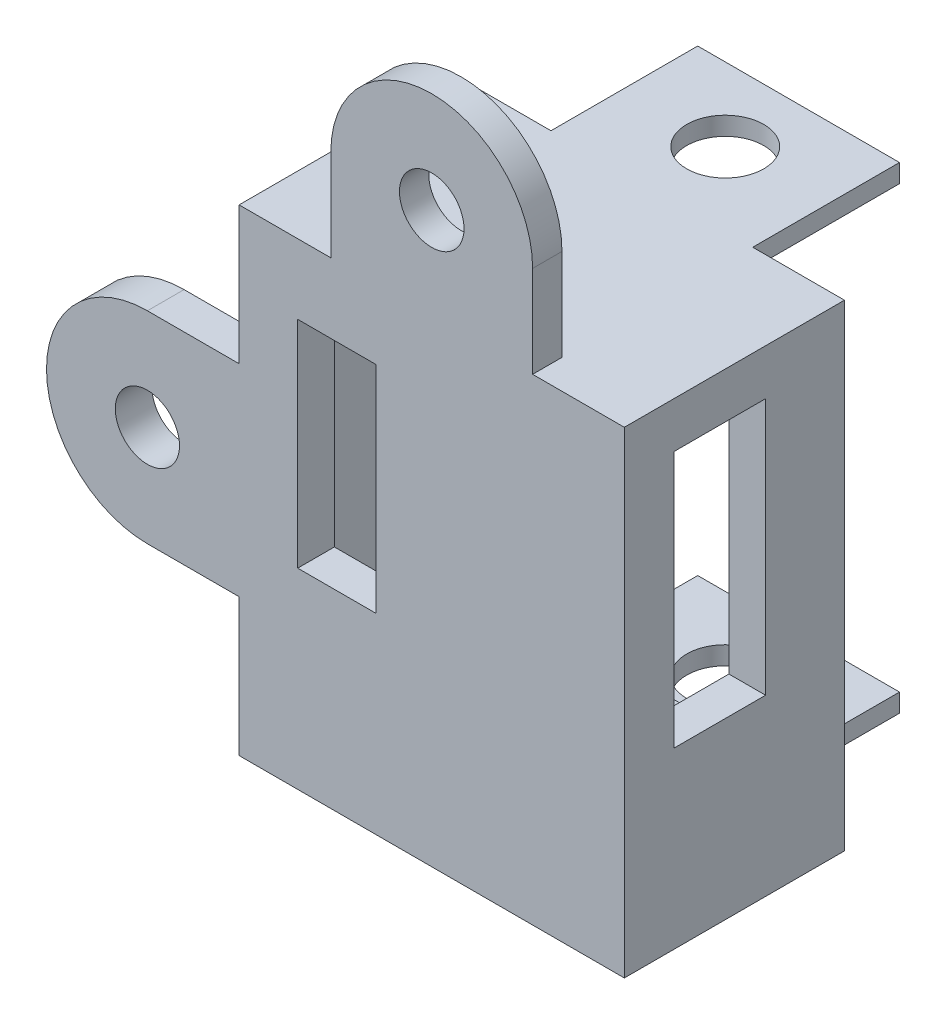
ISO-10303-21;
HEADER;
FILE_DESCRIPTION(('STEP AP214'),'2;1');
FILE_NAME('part.step','',(''),(''),'','','');
FILE_SCHEMA(('AUTOMOTIVE_DESIGN { 1 0 10303 214 1 1 1 1 }'));
ENDSEC;
DATA;
#1=APPLICATION_CONTEXT('core data for automotive mechanical design processes');
#2=APPLICATION_PROTOCOL_DEFINITION('international standard','automotive_design',2000,#1);
#3=PRODUCT_CONTEXT('',#1,'mechanical');
#4=PRODUCT('Part','Part','',(#3));
#5=PRODUCT_RELATED_PRODUCT_CATEGORY('part','',(#4));
#6=PRODUCT_DEFINITION_FORMATION('','',#4);
#7=PRODUCT_DEFINITION_CONTEXT('part definition',#1,'design');
#8=PRODUCT_DEFINITION('design','',#6,#7);
#9=PRODUCT_DEFINITION_SHAPE('','',#8);
#10=(LENGTH_UNIT() NAMED_UNIT(*) SI_UNIT(.MILLI.,.METRE.));
#11=(NAMED_UNIT(*) PLANE_ANGLE_UNIT() SI_UNIT($,.RADIAN.));
#12=(NAMED_UNIT(*) SI_UNIT($,.STERADIAN.) SOLID_ANGLE_UNIT());
#13=UNCERTAINTY_MEASURE_WITH_UNIT(LENGTH_MEASURE(1.E-05),#10,'distance_accuracy_value','');
#14=(GEOMETRIC_REPRESENTATION_CONTEXT(3) GLOBAL_UNCERTAINTY_ASSIGNED_CONTEXT((#13)) GLOBAL_UNIT_ASSIGNED_CONTEXT((#10,
#11,#12)) REPRESENTATION_CONTEXT('',''));
#15=CARTESIAN_POINT('',(0.,0.,0.));
#16=DIRECTION('',(0.,0.,1.));
#17=DIRECTION('',(1.,0.,0.));
#18=AXIS2_PLACEMENT_3D('',#15,#16,#17);
#19=CARTESIAN_POINT('',(-10.5,-13.,10.));
#20=DIRECTION('',(1.,0.,0.));
#21=DIRECTION('',(0.,0.,-1.));
#22=AXIS2_PLACEMENT_3D('',#19,#20,#21);
#23=PLANE('',#22);
#24=DIRECTION('',(0.,0.,1.));
#25=VECTOR('',#24,1.);
#26=CARTESIAN_POINT('',(-10.5,-5.5,10.));
#27=LINE('',#26,#25);
#28=CARTESIAN_POINT('',(-10.5,-5.5,10.));
#29=VERTEX_POINT('',#28);
#30=CARTESIAN_POINT('',(-10.5,-5.5,12.));
#31=VERTEX_POINT('',#30);
#32=EDGE_CURVE('E301',#29,#31,#27,.T.);
#33=ORIENTED_EDGE('',*,*,#32,.F.);
#34=DIRECTION('',(0.,1.,0.));
#35=VECTOR('',#34,1.);
#36=CARTESIAN_POINT('',(-10.5,0.,10.));
#37=LINE('',#36,#35);
#38=CARTESIAN_POINT('',(-10.5,5.5,10.));
#39=VERTEX_POINT('',#38);
#40=EDGE_CURVE('E280',#29,#39,#37,.T.);
#41=ORIENTED_EDGE('',*,*,#40,.T.);
#42=DIRECTION('',(0.,0.,1.));
#43=VECTOR('',#42,1.);
#44=CARTESIAN_POINT('',(-10.5,5.5,10.));
#45=LINE('',#44,#43);
#46=CARTESIAN_POINT('',(-10.5,5.5,12.));
#47=VERTEX_POINT('',#46);
#48=EDGE_CURVE('E293',#39,#47,#45,.T.);
#49=ORIENTED_EDGE('',*,*,#48,.T.);
#50=DIRECTION('',(0.,-1.,0.));
#51=VECTOR('',#50,1.);
#52=CARTESIAN_POINT('',(-10.5,-13.,12.));
#53=LINE('',#52,#51);
#54=CARTESIAN_POINT('',(-10.5,13.,12.));
#55=VERTEX_POINT('',#54);
#56=EDGE_CURVE('E448',#55,#47,#53,.T.);
#57=ORIENTED_EDGE('',*,*,#56,.F.);
#58=DIRECTION('',(0.,0.,-1.));
#59=VECTOR('',#58,1.);
#60=CARTESIAN_POINT('',(-10.5,13.,10.));
#61=LINE('',#60,#59);
#62=CARTESIAN_POINT('',(-10.5,13.,0.));
#63=VERTEX_POINT('',#62);
#64=EDGE_CURVE('E507',#55,#63,#61,.T.);
#65=ORIENTED_EDGE('',*,*,#64,.T.);
#66=DIRECTION('',(0.,-1.,0.));
#67=VECTOR('',#66,1.);
#68=CARTESIAN_POINT('',(-10.5,-13.,0.));
#69=LINE('',#68,#67);
#70=CARTESIAN_POINT('',(-10.5,-13.,0.));
#71=VERTEX_POINT('',#70);
#72=EDGE_CURVE('E495',#63,#71,#69,.T.);
#73=ORIENTED_EDGE('',*,*,#72,.T.);
#74=DIRECTION('',(0.,0.,-1.));
#75=VECTOR('',#74,1.);
#76=CARTESIAN_POINT('',(-10.5,-13.,10.));
#77=LINE('',#76,#75);
#78=CARTESIAN_POINT('',(-10.5,-13.,12.));
#79=VERTEX_POINT('',#78);
#80=EDGE_CURVE('E504',#79,#71,#77,.T.);
#81=ORIENTED_EDGE('',*,*,#80,.F.);
#82=EDGE_CURVE('E447',#31,#79,#53,.T.);
#83=ORIENTED_EDGE('',*,*,#82,.F.);
#84=EDGE_LOOP('',(#33,#41,#49,#57,#65,#73,#81,#83));
#85=FACE_BOUND('',#84,.T.);
#86=ADVANCED_FACE('F36',(#85),#23,.F.);
#87=CARTESIAN_POINT('',(0.,0.,0.));
#88=DIRECTION('',(0.,0.,-1.));
#89=DIRECTION('',(-1.,0.,0.));
#90=AXIS2_PLACEMENT_3D('',#87,#88,#89);
#91=PLANE('',#90);
#92=DIRECTION('',(1.,0.,0.));
#93=VECTOR('',#92,1.);
#94=CARTESIAN_POINT('',(-8.5,-10.5,0.));
#95=LINE('',#94,#93);
#96=CARTESIAN_POINT('',(-8.5,-10.5,0.));
#97=VERTEX_POINT('',#96);
#98=CARTESIAN_POINT('',(8.5,-10.5,0.));
#99=VERTEX_POINT('',#98);
#100=EDGE_CURVE('E458',#97,#99,#95,.T.);
#101=ORIENTED_EDGE('',*,*,#100,.T.);
#102=DIRECTION('',(0.,1.,0.));
#103=VECTOR('',#102,1.);
#104=CARTESIAN_POINT('',(8.5,-10.5,0.));
#105=LINE('',#104,#103);
#106=CARTESIAN_POINT('',(8.5,10.5,0.));
#107=VERTEX_POINT('',#106);
#108=EDGE_CURVE('E453',#99,#107,#105,.T.);
#109=ORIENTED_EDGE('',*,*,#108,.T.);
#110=DIRECTION('',(-1.,0.,0.));
#111=VECTOR('',#110,1.);
#112=CARTESIAN_POINT('',(-8.5,10.5,0.));
#113=LINE('',#112,#111);
#114=CARTESIAN_POINT('',(-8.5,10.5,0.));
#115=VERTEX_POINT('',#114);
#116=EDGE_CURVE('E470',#107,#115,#113,.T.);
#117=ORIENTED_EDGE('',*,*,#116,.T.);
#118=DIRECTION('',(0.,-1.,0.));
#119=VECTOR('',#118,1.);
#120=CARTESIAN_POINT('',(-8.5,-10.5,0.));
#121=LINE('',#120,#119);
#122=EDGE_CURVE('E473',#115,#97,#121,.T.);
#123=ORIENTED_EDGE('',*,*,#122,.T.);
#124=EDGE_LOOP('',(#101,#109,#117,#123));
#125=FACE_BOUND('',#124,.T.);
#126=DIRECTION('',(-1.,0.,0.));
#127=VECTOR('',#126,1.);
#128=CARTESIAN_POINT('',(-5.5,12.,0.));
#129=LINE('',#128,#127);
#130=CARTESIAN_POINT('',(5.5,12.,0.));
#131=VERTEX_POINT('',#130);
#132=CARTESIAN_POINT('',(-5.5,12.,0.));
#133=VERTEX_POINT('',#132);
#134=EDGE_CURVE('E333',#131,#133,#129,.T.);
#135=ORIENTED_EDGE('',*,*,#134,.F.);
#136=DIRECTION('',(0.,-1.,0.));
#137=VECTOR('',#136,1.);
#138=CARTESIAN_POINT('',(5.5,12.,0.));
#139=LINE('',#138,#137);
#140=CARTESIAN_POINT('',(5.5,13.,0.));
#141=VERTEX_POINT('',#140);
#142=EDGE_CURVE('E319',#141,#131,#139,.T.);
#143=ORIENTED_EDGE('',*,*,#142,.F.);
#144=DIRECTION('',(-1.,0.,0.));
#145=VECTOR('',#144,1.);
#146=CARTESIAN_POINT('',(-10.5,13.,0.));
#147=LINE('',#146,#145);
#148=CARTESIAN_POINT('',(10.5,13.,0.));
#149=VERTEX_POINT('',#148);
#150=EDGE_CURVE('E492',#149,#141,#147,.T.);
#151=ORIENTED_EDGE('',*,*,#150,.F.);
#152=DIRECTION('',(0.,1.,0.));
#153=VECTOR('',#152,1.);
#154=CARTESIAN_POINT('',(10.5,-13.,0.));
#155=LINE('',#154,#153);
#156=CARTESIAN_POINT('',(10.5,-13.,0.));
#157=VERTEX_POINT('',#156);
#158=EDGE_CURVE('E488',#157,#149,#155,.T.);
#159=ORIENTED_EDGE('',*,*,#158,.F.);
#160=DIRECTION('',(1.,0.,0.));
#161=VECTOR('',#160,1.);
#162=CARTESIAN_POINT('',(-10.5,-13.,0.));
#163=LINE('',#162,#161);
#164=CARTESIAN_POINT('',(5.49999999999999,-13.,0.));
#165=VERTEX_POINT('',#164);
#166=EDGE_CURVE('E497',#165,#157,#163,.T.);
#167=ORIENTED_EDGE('',*,*,#166,.F.);
#168=DIRECTION('',(0.,-1.,0.));
#169=VECTOR('',#168,1.);
#170=CARTESIAN_POINT('',(5.5,-12.,0.));
#171=LINE('',#170,#169);
#172=CARTESIAN_POINT('',(5.5,-12.,0.));
#173=VERTEX_POINT('',#172);
#174=EDGE_CURVE('E345',#173,#165,#171,.T.);
#175=ORIENTED_EDGE('',*,*,#174,.F.);
#176=DIRECTION('',(1.,0.,0.));
#177=VECTOR('',#176,1.);
#178=CARTESIAN_POINT('',(-5.5,-12.,0.));
#179=LINE('',#178,#177);
#180=CARTESIAN_POINT('',(-5.5,-12.,0.));
#181=VERTEX_POINT('',#180);
#182=EDGE_CURVE('E350',#181,#173,#179,.T.);
#183=ORIENTED_EDGE('',*,*,#182,.F.);
#184=DIRECTION('',(0.,1.,0.));
#185=VECTOR('',#184,1.);
#186=CARTESIAN_POINT('',(-5.5,-13.,0.));
#187=LINE('',#186,#185);
#188=CARTESIAN_POINT('',(-5.5,-13.,0.));
#189=VERTEX_POINT('',#188);
#190=EDGE_CURVE('E359',#189,#181,#187,.T.);
#191=ORIENTED_EDGE('',*,*,#190,.F.);
#192=EDGE_CURVE('E498',#71,#189,#163,.T.);
#193=ORIENTED_EDGE('',*,*,#192,.F.);
#194=ORIENTED_EDGE('',*,*,#72,.F.);
#195=CARTESIAN_POINT('',(-5.5,13.,0.));
#196=VERTEX_POINT('',#195);
#197=EDGE_CURVE('E491',#196,#63,#147,.T.);
#198=ORIENTED_EDGE('',*,*,#197,.F.);
#199=DIRECTION('',(0.,1.,0.));
#200=VECTOR('',#199,1.);
#201=CARTESIAN_POINT('',(-5.5,13.,0.));
#202=LINE('',#201,#200);
#203=EDGE_CURVE('E324',#133,#196,#202,.T.);
#204=ORIENTED_EDGE('',*,*,#203,.F.);
#205=EDGE_LOOP('',(#135,#143,#151,#159,#167,#175,#183,#191,#193,#194,#198,#204));
#206=FACE_BOUND('',#205,.T.);
#207=ADVANCED_FACE('F538',(#125,#206),#91,.T.);
#208=CARTESIAN_POINT('',(-10.5,-13.,10.));
#209=DIRECTION('',(0.,1.,0.));
#210=DIRECTION('',(0.,0.,1.));
#211=AXIS2_PLACEMENT_3D('',#208,#209,#210);
#212=PLANE('',#211);
#213=DIRECTION('',(0.,0.,-1.));
#214=VECTOR('',#213,1.);
#215=CARTESIAN_POINT('',(10.5,-13.,10.));
#216=LINE('',#215,#214);
#217=CARTESIAN_POINT('',(10.5,-13.,12.));
#218=VERTEX_POINT('',#217);
#219=EDGE_CURVE('E501',#218,#157,#216,.T.);
#220=ORIENTED_EDGE('',*,*,#219,.F.);
#221=DIRECTION('',(1.,0.,0.));
#222=VECTOR('',#221,1.);
#223=CARTESIAN_POINT('',(-10.5,-13.,12.));
#224=LINE('',#223,#222);
#225=EDGE_CURVE('E451',#79,#218,#224,.T.);
#226=ORIENTED_EDGE('',*,*,#225,.F.);
#227=ORIENTED_EDGE('',*,*,#80,.T.);
#228=ORIENTED_EDGE('',*,*,#192,.T.);
#229=DIRECTION('',(0.,0.,1.));
#230=VECTOR('',#229,1.);
#231=CARTESIAN_POINT('',(-5.5,-13.,-8.));
#232=LINE('',#231,#230);
#233=CARTESIAN_POINT('',(-5.5,-13.,-8.));
#234=VERTEX_POINT('',#233);
#235=EDGE_CURVE('E369',#234,#189,#232,.T.);
#236=ORIENTED_EDGE('',*,*,#235,.F.);
#237=DIRECTION('',(-1.,0.,0.));
#238=VECTOR('',#237,1.);
#239=CARTESIAN_POINT('',(5.5,-13.,-8.));
#240=LINE('',#239,#238);
#241=CARTESIAN_POINT('',(5.5,-13.,-8.));
#242=VERTEX_POINT('',#241);
#243=EDGE_CURVE('E349',#242,#234,#240,.T.);
#244=ORIENTED_EDGE('',*,*,#243,.F.);
#245=DIRECTION('',(0.,0.,1.));
#246=VECTOR('',#245,1.);
#247=CARTESIAN_POINT('',(5.5,-13.,-8.));
#248=LINE('',#247,#246);
#249=EDGE_CURVE('E372',#242,#165,#248,.T.);
#250=ORIENTED_EDGE('',*,*,#249,.T.);
#251=ORIENTED_EDGE('',*,*,#166,.T.);
#252=EDGE_LOOP('',(#220,#226,#227,#228,#236,#244,#250,#251));
#253=FACE_BOUND('',#252,.T.);
#254=CARTESIAN_POINT('',(0.,-13.,-4.));
#255=DIRECTION('',(0.,1.,0.));
#256=DIRECTION('',(0.,0.,1.));
#257=AXIS2_PLACEMENT_3D('',#254,#255,#256);
#258=CIRCLE('',#257,2.1);
#259=CARTESIAN_POINT('',(0.,-13.,-1.9));
#260=VERTEX_POINT('',#259);
#261=EDGE_CURVE('E316',#260,#260,#258,.T.);
#262=ORIENTED_EDGE('',*,*,#261,.T.);
#263=EDGE_LOOP('',(#262));
#264=FACE_BOUND('',#263,.T.);
#265=ADVANCED_FACE('F544',(#253,#264),#212,.F.);
#266=CARTESIAN_POINT('',(-10.5,13.,10.));
#267=DIRECTION('',(0.,-1.,0.));
#268=DIRECTION('',(0.,0.,-1.));
#269=AXIS2_PLACEMENT_3D('',#266,#267,#268);
#270=PLANE('',#269);
#271=CARTESIAN_POINT('',(0.,13.,-4.));
#272=DIRECTION('',(0.,1.,0.));
#273=DIRECTION('',(0.,0.,1.));
#274=AXIS2_PLACEMENT_3D('',#271,#272,#273);
#275=CIRCLE('',#274,2.1);
#276=CARTESIAN_POINT('',(0.,13.,-1.9));
#277=VERTEX_POINT('',#276);
#278=EDGE_CURVE('E303',#277,#277,#275,.T.);
#279=ORIENTED_EDGE('',*,*,#278,.F.);
#280=EDGE_LOOP('',(#279));
#281=FACE_BOUND('',#280,.T.);
#282=DIRECTION('',(0.,0.,1.));
#283=VECTOR('',#282,1.);
#284=CARTESIAN_POINT('',(-5.5,13.,10.4));
#285=LINE('',#284,#283);
#286=CARTESIAN_POINT('',(-5.5,13.,10.4));
#287=VERTEX_POINT('',#286);
#288=CARTESIAN_POINT('',(-5.5,13.,12.));
#289=VERTEX_POINT('',#288);
#290=EDGE_CURVE('E403',#287,#289,#285,.T.);
#291=ORIENTED_EDGE('',*,*,#290,.F.);
#292=DIRECTION('',(1.,0.,0.));
#293=VECTOR('',#292,1.);
#294=CARTESIAN_POINT('',(0.,13.,10.4));
#295=LINE('',#294,#293);
#296=CARTESIAN_POINT('',(5.5,13.,10.4));
#297=VERTEX_POINT('',#296);
#298=EDGE_CURVE('E382',#287,#297,#295,.T.);
#299=ORIENTED_EDGE('',*,*,#298,.T.);
#300=DIRECTION('',(0.,0.,1.));
#301=VECTOR('',#300,1.);
#302=CARTESIAN_POINT('',(5.5,13.,10.4));
#303=LINE('',#302,#301);
#304=CARTESIAN_POINT('',(5.5,13.,12.));
#305=VERTEX_POINT('',#304);
#306=EDGE_CURVE('E395',#297,#305,#303,.T.);
#307=ORIENTED_EDGE('',*,*,#306,.T.);
#308=DIRECTION('',(-1.,0.,0.));
#309=VECTOR('',#308,1.);
#310=CARTESIAN_POINT('',(-10.5,13.,12.));
#311=LINE('',#310,#309);
#312=CARTESIAN_POINT('',(10.5,13.,12.));
#313=VERTEX_POINT('',#312);
#314=EDGE_CURVE('E444',#313,#305,#311,.T.);
#315=ORIENTED_EDGE('',*,*,#314,.F.);
#316=DIRECTION('',(0.,0.,-1.));
#317=VECTOR('',#316,1.);
#318=CARTESIAN_POINT('',(10.5,13.,10.));
#319=LINE('',#318,#317);
#320=EDGE_CURVE('E510',#313,#149,#319,.T.);
#321=ORIENTED_EDGE('',*,*,#320,.T.);
#322=ORIENTED_EDGE('',*,*,#150,.T.);
#323=DIRECTION('',(0.,0.,1.));
#324=VECTOR('',#323,1.);
#325=CARTESIAN_POINT('',(5.5,13.,-8.));
#326=LINE('',#325,#324);
#327=CARTESIAN_POINT('',(5.5,13.,-8.));
#328=VERTEX_POINT('',#327);
#329=EDGE_CURVE('E330',#328,#141,#326,.T.);
#330=ORIENTED_EDGE('',*,*,#329,.F.);
#331=DIRECTION('',(1.,0.,0.));
#332=VECTOR('',#331,1.);
#333=CARTESIAN_POINT('',(5.5,13.,-8.));
#334=LINE('',#333,#332);
#335=CARTESIAN_POINT('',(-5.5,13.,-8.));
#336=VERTEX_POINT('',#335);
#337=EDGE_CURVE('E328',#336,#328,#334,.T.);
#338=ORIENTED_EDGE('',*,*,#337,.F.);
#339=DIRECTION('',(0.,0.,1.));
#340=VECTOR('',#339,1.);
#341=CARTESIAN_POINT('',(-5.5,13.,-8.));
#342=LINE('',#341,#340);
#343=EDGE_CURVE('E338',#336,#196,#342,.T.);
#344=ORIENTED_EDGE('',*,*,#343,.T.);
#345=ORIENTED_EDGE('',*,*,#197,.T.);
#346=ORIENTED_EDGE('',*,*,#64,.F.);
#347=EDGE_CURVE('E443',#289,#55,#311,.T.);
#348=ORIENTED_EDGE('',*,*,#347,.F.);
#349=EDGE_LOOP('',(#291,#299,#307,#315,#321,#322,#330,#338,#344,#345,#346,#348));
#350=FACE_BOUND('',#349,.T.);
#351=ADVANCED_FACE('F549',(#281,#350),#270,.F.);
#352=CARTESIAN_POINT('',(10.5,-13.,10.));
#353=DIRECTION('',(-1.,0.,0.));
#354=DIRECTION('',(0.,0.,1.));
#355=AXIS2_PLACEMENT_3D('',#352,#353,#354);
#356=PLANE('',#355);
#357=ORIENTED_EDGE('',*,*,#158,.T.);
#358=ORIENTED_EDGE('',*,*,#320,.F.);
#359=DIRECTION('',(0.,1.,0.));
#360=VECTOR('',#359,1.);
#361=CARTESIAN_POINT('',(10.5,-13.,12.));
#362=LINE('',#361,#360);
#363=EDGE_CURVE('E434',#218,#313,#362,.T.);
#364=ORIENTED_EDGE('',*,*,#363,.F.);
#365=ORIENTED_EDGE('',*,*,#219,.T.);
#366=EDGE_LOOP('',(#357,#358,#364,#365));
#367=FACE_BOUND('',#366,.T.);
#368=DIRECTION('',(0.,0.,-1.));
#369=VECTOR('',#368,1.);
#370=CARTESIAN_POINT('',(10.5,10.5,0.));
#371=LINE('',#370,#369);
#372=CARTESIAN_POINT('',(10.5,10.5,9.3));
#373=VERTEX_POINT('',#372);
#374=CARTESIAN_POINT('',(10.5,10.5,4.3));
#375=VERTEX_POINT('',#374);
#376=EDGE_CURVE('E405',#373,#375,#371,.T.);
#377=ORIENTED_EDGE('',*,*,#376,.T.);
#378=DIRECTION('',(0.,-1.,0.));
#379=VECTOR('',#378,1.);
#380=CARTESIAN_POINT('',(10.5,0.,4.3));
#381=LINE('',#380,#379);
#382=CARTESIAN_POINT('',(10.5,-3.5,4.3));
#383=VERTEX_POINT('',#382);
#384=EDGE_CURVE('E416',#375,#383,#381,.T.);
#385=ORIENTED_EDGE('',*,*,#384,.T.);
#386=DIRECTION('',(0.,0.,1.));
#387=VECTOR('',#386,1.);
#388=CARTESIAN_POINT('',(10.5,-3.5,0.));
#389=LINE('',#388,#387);
#390=CARTESIAN_POINT('',(10.5,-3.5,9.3));
#391=VERTEX_POINT('',#390);
#392=EDGE_CURVE('E426',#383,#391,#389,.T.);
#393=ORIENTED_EDGE('',*,*,#392,.T.);
#394=DIRECTION('',(0.,1.,0.));
#395=VECTOR('',#394,1.);
#396=CARTESIAN_POINT('',(10.5,0.,9.3));
#397=LINE('',#396,#395);
#398=EDGE_CURVE('E423',#391,#373,#397,.T.);
#399=ORIENTED_EDGE('',*,*,#398,.T.);
#400=EDGE_LOOP('',(#377,#385,#393,#399));
#401=FACE_BOUND('',#400,.T.);
#402=ADVANCED_FACE('F38',(#367,#401),#356,.F.);
#403=CARTESIAN_POINT('',(8.5,-10.5,10.));
#404=DIRECTION('',(-1.,0.,0.));
#405=DIRECTION('',(0.,0.,1.));
#406=AXIS2_PLACEMENT_3D('',#403,#404,#405);
#407=PLANE('',#406);
#408=DIRECTION('',(0.,0.,1.));
#409=VECTOR('',#408,1.);
#410=CARTESIAN_POINT('',(8.5,-3.5,0.));
#411=LINE('',#410,#409);
#412=CARTESIAN_POINT('',(8.5,-3.5,4.3));
#413=VERTEX_POINT('',#412);
#414=CARTESIAN_POINT('',(8.5,-3.5,9.3));
#415=VERTEX_POINT('',#414);
#416=EDGE_CURVE('E415',#413,#415,#411,.T.);
#417=ORIENTED_EDGE('',*,*,#416,.F.);
#418=DIRECTION('',(0.,-1.,0.));
#419=VECTOR('',#418,1.);
#420=CARTESIAN_POINT('',(8.5,0.,4.3));
#421=LINE('',#420,#419);
#422=CARTESIAN_POINT('',(8.5,10.5,4.3));
#423=VERTEX_POINT('',#422);
#424=EDGE_CURVE('E418',#423,#413,#421,.T.);
#425=ORIENTED_EDGE('',*,*,#424,.F.);
#426=DIRECTION('',(0.,0.,-1.));
#427=VECTOR('',#426,1.);
#428=CARTESIAN_POINT('',(8.5,10.5,10.));
#429=LINE('',#428,#427);
#430=EDGE_CURVE('E484',#423,#107,#429,.T.);
#431=ORIENTED_EDGE('',*,*,#430,.T.);
#432=ORIENTED_EDGE('',*,*,#108,.F.);
#433=DIRECTION('',(0.,0.,-1.));
#434=VECTOR('',#433,1.);
#435=CARTESIAN_POINT('',(8.5,-10.5,10.));
#436=LINE('',#435,#434);
#437=CARTESIAN_POINT('',(8.5,-10.5,10.));
#438=VERTEX_POINT('',#437);
#439=EDGE_CURVE('E467',#438,#99,#436,.T.);
#440=ORIENTED_EDGE('',*,*,#439,.F.);
#441=DIRECTION('',(0.,1.,0.));
#442=VECTOR('',#441,1.);
#443=CARTESIAN_POINT('',(8.5,-10.5,10.));
#444=LINE('',#443,#442);
#445=CARTESIAN_POINT('',(8.5,10.5,10.));
#446=VERTEX_POINT('',#445);
#447=EDGE_CURVE('E454',#438,#446,#444,.T.);
#448=ORIENTED_EDGE('',*,*,#447,.T.);
#449=CARTESIAN_POINT('',(8.5,10.5,9.3));
#450=VERTEX_POINT('',#449);
#451=EDGE_CURVE('E485',#446,#450,#429,.T.);
#452=ORIENTED_EDGE('',*,*,#451,.T.);
#453=DIRECTION('',(0.,1.,0.));
#454=VECTOR('',#453,1.);
#455=CARTESIAN_POINT('',(8.5,0.,9.3));
#456=LINE('',#455,#454);
#457=EDGE_CURVE('E412',#415,#450,#456,.T.);
#458=ORIENTED_EDGE('',*,*,#457,.F.);
#459=EDGE_LOOP('',(#417,#425,#431,#432,#440,#448,#452,#458));
#460=FACE_BOUND('',#459,.T.);
#461=ADVANCED_FACE('F556',(#460),#407,.T.);
#462=CARTESIAN_POINT('',(-8.5,10.5,10.));
#463=DIRECTION('',(0.,-1.,0.));
#464=DIRECTION('',(0.,0.,-1.));
#465=AXIS2_PLACEMENT_3D('',#462,#463,#464);
#466=PLANE('',#465);
#467=ORIENTED_EDGE('',*,*,#116,.F.);
#468=ORIENTED_EDGE('',*,*,#430,.F.);
#469=DIRECTION('',(1.,0.,0.));
#470=VECTOR('',#469,1.);
#471=CARTESIAN_POINT('',(8.5,10.5,4.3));
#472=LINE('',#471,#470);
#473=EDGE_CURVE('E431',#423,#375,#472,.T.);
#474=ORIENTED_EDGE('',*,*,#473,.T.);
#475=ORIENTED_EDGE('',*,*,#376,.F.);
#476=DIRECTION('',(1.,0.,0.));
#477=VECTOR('',#476,1.);
#478=CARTESIAN_POINT('',(8.5,10.5,9.3));
#479=LINE('',#478,#477);
#480=EDGE_CURVE('E420',#450,#373,#479,.T.);
#481=ORIENTED_EDGE('',*,*,#480,.F.);
#482=ORIENTED_EDGE('',*,*,#451,.F.);
#483=DIRECTION('',(-1.,0.,0.));
#484=VECTOR('',#483,1.);
#485=CARTESIAN_POINT('',(-8.5,10.5,10.));
#486=LINE('',#485,#484);
#487=CARTESIAN_POINT('',(-8.5,10.5,10.));
#488=VERTEX_POINT('',#487);
#489=EDGE_CURVE('E457',#446,#488,#486,.T.);
#490=ORIENTED_EDGE('',*,*,#489,.T.);
#491=DIRECTION('',(0.,0.,-1.));
#492=VECTOR('',#491,1.);
#493=CARTESIAN_POINT('',(-8.5,10.5,10.));
#494=LINE('',#493,#492);
#495=EDGE_CURVE('E482',#488,#115,#494,.T.);
#496=ORIENTED_EDGE('',*,*,#495,.T.);
#497=EDGE_LOOP('',(#467,#468,#474,#475,#481,#482,#490,#496));
#498=FACE_BOUND('',#497,.T.);
#499=ADVANCED_FACE('F670',(#498),#466,.T.);
#500=CARTESIAN_POINT('',(-8.5,-10.5,10.));
#501=DIRECTION('',(1.,0.,0.));
#502=DIRECTION('',(0.,0.,-1.));
#503=AXIS2_PLACEMENT_3D('',#500,#501,#502);
#504=PLANE('',#503);
#505=ORIENTED_EDGE('',*,*,#122,.F.);
#506=ORIENTED_EDGE('',*,*,#495,.F.);
#507=DIRECTION('',(0.,-1.,0.));
#508=VECTOR('',#507,1.);
#509=CARTESIAN_POINT('',(-8.5,-10.5,10.));
#510=LINE('',#509,#508);
#511=CARTESIAN_POINT('',(-8.5,-10.5,10.));
#512=VERTEX_POINT('',#511);
#513=EDGE_CURVE('E461',#488,#512,#510,.T.);
#514=ORIENTED_EDGE('',*,*,#513,.T.);
#515=DIRECTION('',(0.,0.,-1.));
#516=VECTOR('',#515,1.);
#517=CARTESIAN_POINT('',(-8.5,-10.5,10.));
#518=LINE('',#517,#516);
#519=EDGE_CURVE('E480',#512,#97,#518,.T.);
#520=ORIENTED_EDGE('',*,*,#519,.T.);
#521=EDGE_LOOP('',(#505,#506,#514,#520));
#522=FACE_BOUND('',#521,.T.);
#523=ADVANCED_FACE('F666',(#522),#504,.T.);
#524=CARTESIAN_POINT('',(-8.5,-10.5,10.));
#525=DIRECTION('',(0.,1.,0.));
#526=DIRECTION('',(0.,0.,1.));
#527=AXIS2_PLACEMENT_3D('',#524,#525,#526);
#528=PLANE('',#527);
#529=ORIENTED_EDGE('',*,*,#100,.F.);
#530=ORIENTED_EDGE('',*,*,#519,.F.);
#531=DIRECTION('',(1.,0.,0.));
#532=VECTOR('',#531,1.);
#533=CARTESIAN_POINT('',(-8.5,-10.5,10.));
#534=LINE('',#533,#532);
#535=EDGE_CURVE('E464',#512,#438,#534,.T.);
#536=ORIENTED_EDGE('',*,*,#535,.T.);
#537=ORIENTED_EDGE('',*,*,#439,.T.);
#538=EDGE_LOOP('',(#529,#530,#536,#537));
#539=FACE_BOUND('',#538,.T.);
#540=ADVANCED_FACE('F663',(#539),#528,.T.);
#541=CARTESIAN_POINT('',(0.,0.,10.));
#542=DIRECTION('',(0.,0.,-1.));
#543=DIRECTION('',(-1.,0.,0.));
#544=AXIS2_PLACEMENT_3D('',#541,#542,#543);
#545=PLANE('',#544);
#546=DIRECTION('',(0.,1.,0.));
#547=VECTOR('',#546,1.);
#548=CARTESIAN_POINT('',(-7.30590858875227,9.19401225804892,10.));
#549=LINE('',#548,#547);
#550=CARTESIAN_POINT('',(-7.30590858875227,-2.55391953837646,10.));
#551=VERTEX_POINT('',#550);
#552=CARTESIAN_POINT('',(-7.30590858875227,9.19401225804892,10.));
#553=VERTEX_POINT('',#552);
#554=EDGE_CURVE('E51',#551,#553,#549,.T.);
#555=ORIENTED_EDGE('',*,*,#554,.F.);
#556=DIRECTION('',(-1.,0.,0.));
#557=VECTOR('',#556,1.);
#558=CARTESIAN_POINT('',(-7.30590858875227,-2.55391953837646,10.));
#559=LINE('',#558,#557);
#560=CARTESIAN_POINT('',(-3.0256543683489,-2.55391953837646,10.));
#561=VERTEX_POINT('',#560);
#562=EDGE_CURVE('E264',#561,#551,#559,.T.);
#563=ORIENTED_EDGE('',*,*,#562,.F.);
#564=DIRECTION('',(0.,-1.,0.));
#565=VECTOR('',#564,1.);
#566=CARTESIAN_POINT('',(-3.0256543683489,9.19401225804892,10.));
#567=LINE('',#566,#565);
#568=CARTESIAN_POINT('',(-3.0256543683489,9.19401225804892,10.));
#569=VERTEX_POINT('',#568);
#570=EDGE_CURVE('E248',#569,#561,#567,.T.);
#571=ORIENTED_EDGE('',*,*,#570,.F.);
#572=DIRECTION('',(1.,0.,0.));
#573=VECTOR('',#572,1.);
#574=CARTESIAN_POINT('',(-7.30590858875227,9.19401225804892,10.));
#575=LINE('',#574,#573);
#576=EDGE_CURVE('E257',#553,#569,#575,.T.);
#577=ORIENTED_EDGE('',*,*,#576,.F.);
#578=EDGE_LOOP('',(#555,#563,#571,#577));
#579=FACE_BOUND('',#578,.T.);
#580=ORIENTED_EDGE('',*,*,#447,.F.);
#581=ORIENTED_EDGE('',*,*,#535,.F.);
#582=ORIENTED_EDGE('',*,*,#513,.F.);
#583=ORIENTED_EDGE('',*,*,#489,.F.);
#584=EDGE_LOOP('',(#580,#581,#582,#583));
#585=FACE_BOUND('',#584,.T.);
#586=ADVANCED_FACE('F261',(#579,#585),#545,.T.);
#587=CARTESIAN_POINT('',(0.,0.,12.));
#588=DIRECTION('',(0.,0.,-1.));
#589=DIRECTION('',(-1.,0.,0.));
#590=AXIS2_PLACEMENT_3D('',#587,#588,#589);
#591=PLANE('',#590);
#592=DIRECTION('',(-1.,0.,0.));
#593=VECTOR('',#592,1.);
#594=CARTESIAN_POINT('',(0.,-2.55391953837646,12.));
#595=LINE('',#594,#593);
#596=CARTESIAN_POINT('',(-3.0256543683489,-2.55391953837646,12.));
#597=VERTEX_POINT('',#596);
#598=CARTESIAN_POINT('',(-7.30590858875227,-2.55391953837646,12.));
#599=VERTEX_POINT('',#598);
#600=EDGE_CURVE('E44',#597,#599,#595,.T.);
#601=ORIENTED_EDGE('',*,*,#600,.T.);
#602=DIRECTION('',(0.,1.,0.));
#603=VECTOR('',#602,1.);
#604=CARTESIAN_POINT('',(-7.30590858875227,0.,12.));
#605=LINE('',#604,#603);
#606=CARTESIAN_POINT('',(-7.30590858875227,9.19401225804892,12.));
#607=VERTEX_POINT('',#606);
#608=EDGE_CURVE('E11',#599,#607,#605,.T.);
#609=ORIENTED_EDGE('',*,*,#608,.T.);
#610=DIRECTION('',(1.,0.,0.));
#611=VECTOR('',#610,1.);
#612=CARTESIAN_POINT('',(0.,9.19401225804892,12.));
#613=LINE('',#612,#611);
#614=CARTESIAN_POINT('',(-3.0256543683489,9.19401225804892,12.));
#615=VERTEX_POINT('',#614);
#616=EDGE_CURVE('E513',#607,#615,#613,.T.);
#617=ORIENTED_EDGE('',*,*,#616,.T.);
#618=DIRECTION('',(0.,-1.,0.));
#619=VECTOR('',#618,1.);
#620=CARTESIAN_POINT('',(-3.0256543683489,0.,12.));
#621=LINE('',#620,#619);
#622=EDGE_CURVE('E251',#615,#597,#621,.T.);
#623=ORIENTED_EDGE('',*,*,#622,.T.);
#624=EDGE_LOOP('',(#601,#609,#617,#623));
#625=FACE_BOUND('',#624,.T.);
#626=ORIENTED_EDGE('',*,*,#225,.T.);
#627=ORIENTED_EDGE('',*,*,#363,.T.);
#628=ORIENTED_EDGE('',*,*,#314,.T.);
#629=DIRECTION('',(0.,1.,0.));
#630=VECTOR('',#629,1.);
#631=CARTESIAN_POINT('',(5.5,13.,12.));
#632=LINE('',#631,#630);
#633=CARTESIAN_POINT('',(5.5,18.,12.));
#634=VERTEX_POINT('',#633);
#635=EDGE_CURVE('E379',#305,#634,#632,.T.);
#636=ORIENTED_EDGE('',*,*,#635,.T.);
#637=CARTESIAN_POINT('',(0.,18.,12.));
#638=DIRECTION('',(0.,0.,1.));
#639=DIRECTION('',(1.,0.,0.));
#640=AXIS2_PLACEMENT_3D('',#637,#638,#639);
#641=CIRCLE('',#640,5.5);
#642=CARTESIAN_POINT('',(-5.5,18.,12.));
#643=VERTEX_POINT('',#642);
#644=EDGE_CURVE('E398',#634,#643,#641,.T.);
#645=ORIENTED_EDGE('',*,*,#644,.T.);
#646=DIRECTION('',(0.,-1.,0.));
#647=VECTOR('',#646,1.);
#648=CARTESIAN_POINT('',(-5.5,13.,12.));
#649=LINE('',#648,#647);
#650=EDGE_CURVE('E386',#643,#289,#649,.T.);
#651=ORIENTED_EDGE('',*,*,#650,.T.);
#652=ORIENTED_EDGE('',*,*,#347,.T.);
#653=ORIENTED_EDGE('',*,*,#56,.T.);
#654=DIRECTION('',(-1.,0.,0.));
#655=VECTOR('',#654,1.);
#656=CARTESIAN_POINT('',(-10.5,5.5,12.));
#657=LINE('',#656,#655);
#658=CARTESIAN_POINT('',(-15.5,5.5,12.));
#659=VERTEX_POINT('',#658);
#660=EDGE_CURVE('E277',#47,#659,#657,.T.);
#661=ORIENTED_EDGE('',*,*,#660,.T.);
#662=CARTESIAN_POINT('',(-15.5,0.,12.));
#663=DIRECTION('',(0.,0.,1.));
#664=DIRECTION('',(-1.,0.,0.));
#665=AXIS2_PLACEMENT_3D('',#662,#663,#664);
#666=CIRCLE('',#665,5.5);
#667=CARTESIAN_POINT('',(-15.5,-5.5,12.));
#668=VERTEX_POINT('',#667);
#669=EDGE_CURVE('E296',#659,#668,#666,.T.);
#670=ORIENTED_EDGE('',*,*,#669,.T.);
#671=DIRECTION('',(1.,0.,0.));
#672=VECTOR('',#671,1.);
#673=CARTESIAN_POINT('',(-10.5,-5.5,12.));
#674=LINE('',#673,#672);
#675=EDGE_CURVE('E284',#668,#31,#674,.T.);
#676=ORIENTED_EDGE('',*,*,#675,.T.);
#677=ORIENTED_EDGE('',*,*,#82,.T.);
#678=EDGE_LOOP('',(#626,#627,#628,#636,#645,#651,#652,#653,#661,#670,#676,#677));
#679=FACE_BOUND('',#678,.T.);
#680=CARTESIAN_POINT('',(0.,18.,12.));
#681=DIRECTION('',(0.,0.,1.));
#682=DIRECTION('',(1.,0.,0.));
#683=AXIS2_PLACEMENT_3D('',#680,#681,#682);
#684=CIRCLE('',#683,1.76);
#685=CARTESIAN_POINT('',(1.76,18.,12.));
#686=VERTEX_POINT('',#685);
#687=EDGE_CURVE('E375',#686,#686,#684,.T.);
#688=ORIENTED_EDGE('',*,*,#687,.F.);
#689=EDGE_LOOP('',(#688));
#690=FACE_BOUND('',#689,.T.);
#691=CARTESIAN_POINT('',(-15.5,0.,12.));
#692=DIRECTION('',(0.,0.,1.));
#693=DIRECTION('',(1.,0.,0.));
#694=AXIS2_PLACEMENT_3D('',#691,#692,#693);
#695=CIRCLE('',#694,1.75);
#696=CARTESIAN_POINT('',(-13.75,0.,12.));
#697=VERTEX_POINT('',#696);
#698=EDGE_CURVE('E271',#697,#697,#695,.T.);
#699=ORIENTED_EDGE('',*,*,#698,.F.);
#700=EDGE_LOOP('',(#699));
#701=FACE_BOUND('',#700,.T.);
#702=ADVANCED_FACE('F519',(#625,#679,#690,#701),#591,.F.);
#703=CARTESIAN_POINT('',(8.5,0.,4.3));
#704=DIRECTION('',(0.,0.,1.));
#705=DIRECTION('',(0.,-1.,0.));
#706=AXIS2_PLACEMENT_3D('',#703,#704,#705);
#707=PLANE('',#706);
#708=ORIENTED_EDGE('',*,*,#384,.F.);
#709=ORIENTED_EDGE('',*,*,#473,.F.);
#710=ORIENTED_EDGE('',*,*,#424,.T.);
#711=DIRECTION('',(1.,0.,0.));
#712=VECTOR('',#711,1.);
#713=CARTESIAN_POINT('',(8.5,-3.5,4.3));
#714=LINE('',#713,#712);
#715=EDGE_CURVE('E435',#413,#383,#714,.T.);
#716=ORIENTED_EDGE('',*,*,#715,.T.);
#717=EDGE_LOOP('',(#708,#709,#710,#716));
#718=FACE_BOUND('',#717,.T.);
#719=ADVANCED_FACE('F648',(#718),#707,.T.);
#720=CARTESIAN_POINT('',(8.5,-3.5,0.));
#721=DIRECTION('',(0.,1.,0.));
#722=DIRECTION('',(0.,0.,1.));
#723=AXIS2_PLACEMENT_3D('',#720,#721,#722);
#724=PLANE('',#723);
#725=ORIENTED_EDGE('',*,*,#392,.F.);
#726=ORIENTED_EDGE('',*,*,#715,.F.);
#727=ORIENTED_EDGE('',*,*,#416,.T.);
#728=DIRECTION('',(1.,0.,0.));
#729=VECTOR('',#728,1.);
#730=CARTESIAN_POINT('',(8.5,-3.5,9.3));
#731=LINE('',#730,#729);
#732=EDGE_CURVE('E437',#415,#391,#731,.T.);
#733=ORIENTED_EDGE('',*,*,#732,.T.);
#734=EDGE_LOOP('',(#725,#726,#727,#733));
#735=FACE_BOUND('',#734,.T.);
#736=ADVANCED_FACE('F651',(#735),#724,.T.);
#737=CARTESIAN_POINT('',(8.5,0.,9.3));
#738=DIRECTION('',(0.,0.,-1.));
#739=DIRECTION('',(-1.,0.,0.));
#740=AXIS2_PLACEMENT_3D('',#737,#738,#739);
#741=PLANE('',#740);
#742=ORIENTED_EDGE('',*,*,#398,.F.);
#743=ORIENTED_EDGE('',*,*,#732,.F.);
#744=ORIENTED_EDGE('',*,*,#457,.T.);
#745=ORIENTED_EDGE('',*,*,#480,.T.);
#746=EDGE_LOOP('',(#742,#743,#744,#745));
#747=FACE_BOUND('',#746,.T.);
#748=ADVANCED_FACE('F643',(#747),#741,.T.);
#749=CARTESIAN_POINT('',(-5.5,13.,10.4));
#750=DIRECTION('',(-1.,0.,0.));
#751=DIRECTION('',(0.,0.,1.));
#752=AXIS2_PLACEMENT_3D('',#749,#750,#751);
#753=PLANE('',#752);
#754=ORIENTED_EDGE('',*,*,#650,.F.);
#755=DIRECTION('',(0.,0.,1.));
#756=VECTOR('',#755,1.);
#757=CARTESIAN_POINT('',(-5.5,18.,10.4));
#758=LINE('',#757,#756);
#759=CARTESIAN_POINT('',(-5.5,18.,10.4));
#760=VERTEX_POINT('',#759);
#761=EDGE_CURVE('E406',#760,#643,#758,.T.);
#762=ORIENTED_EDGE('',*,*,#761,.F.);
#763=DIRECTION('',(0.,-1.,0.));
#764=VECTOR('',#763,1.);
#765=CARTESIAN_POINT('',(-5.5,13.,10.4));
#766=LINE('',#765,#764);
#767=EDGE_CURVE('E392',#760,#287,#766,.T.);
#768=ORIENTED_EDGE('',*,*,#767,.T.);
#769=ORIENTED_EDGE('',*,*,#290,.T.);
#770=EDGE_LOOP('',(#754,#762,#768,#769));
#771=FACE_BOUND('',#770,.T.);
#772=ADVANCED_FACE('F566',(#771),#753,.T.);
#773=CARTESIAN_POINT('',(0.,18.,10.4));
#774=DIRECTION('',(0.,0.,1.));
#775=DIRECTION('',(1.,0.,0.));
#776=AXIS2_PLACEMENT_3D('',#773,#774,#775);
#777=CYLINDRICAL_SURFACE('',#776,5.5);
#778=ORIENTED_EDGE('',*,*,#644,.F.);
#779=DIRECTION('',(0.,0.,1.));
#780=VECTOR('',#779,1.);
#781=CARTESIAN_POINT('',(5.5,18.,10.4));
#782=LINE('',#781,#780);
#783=CARTESIAN_POINT('',(5.5,18.,10.4));
#784=VERTEX_POINT('',#783);
#785=EDGE_CURVE('E408',#784,#634,#782,.T.);
#786=ORIENTED_EDGE('',*,*,#785,.F.);
#787=CARTESIAN_POINT('',(0.,18.,10.4));
#788=DIRECTION('',(0.,0.,1.));
#789=DIRECTION('',(1.,0.,0.));
#790=AXIS2_PLACEMENT_3D('',#787,#788,#789);
#791=CIRCLE('',#790,5.5);
#792=EDGE_CURVE('E389',#784,#760,#791,.T.);
#793=ORIENTED_EDGE('',*,*,#792,.T.);
#794=ORIENTED_EDGE('',*,*,#761,.T.);
#795=EDGE_LOOP('',(#778,#786,#793,#794));
#796=FACE_BOUND('',#795,.T.);
#797=ADVANCED_FACE('F571',(#796),#777,.T.);
#798=CARTESIAN_POINT('',(5.5,13.,10.4));
#799=DIRECTION('',(1.,0.,0.));
#800=DIRECTION('',(0.,0.,-1.));
#801=AXIS2_PLACEMENT_3D('',#798,#799,#800);
#802=PLANE('',#801);
#803=ORIENTED_EDGE('',*,*,#635,.F.);
#804=ORIENTED_EDGE('',*,*,#306,.F.);
#805=DIRECTION('',(0.,1.,0.));
#806=VECTOR('',#805,1.);
#807=CARTESIAN_POINT('',(5.5,13.,10.4));
#808=LINE('',#807,#806);
#809=EDGE_CURVE('E385',#297,#784,#808,.T.);
#810=ORIENTED_EDGE('',*,*,#809,.T.);
#811=ORIENTED_EDGE('',*,*,#785,.T.);
#812=EDGE_LOOP('',(#803,#804,#810,#811));
#813=FACE_BOUND('',#812,.T.);
#814=ADVANCED_FACE('F577',(#813),#802,.T.);
#815=CARTESIAN_POINT('',(0.,18.,10.4));
#816=DIRECTION('',(0.,0.,1.));
#817=DIRECTION('',(1.,0.,0.));
#818=AXIS2_PLACEMENT_3D('',#815,#816,#817);
#819=PLANE('',#818);
#820=CARTESIAN_POINT('',(0.,18.,10.4));
#821=DIRECTION('',(0.,0.,1.));
#822=DIRECTION('',(1.,0.,0.));
#823=AXIS2_PLACEMENT_3D('',#820,#821,#822);
#824=CIRCLE('',#823,1.76);
#825=CARTESIAN_POINT('',(1.76,18.,10.4));
#826=VERTEX_POINT('',#825);
#827=EDGE_CURVE('E376',#826,#826,#824,.T.);
#828=ORIENTED_EDGE('',*,*,#827,.T.);
#829=EDGE_LOOP('',(#828));
#830=FACE_BOUND('',#829,.T.);
#831=ORIENTED_EDGE('',*,*,#298,.F.);
#832=ORIENTED_EDGE('',*,*,#767,.F.);
#833=ORIENTED_EDGE('',*,*,#792,.F.);
#834=ORIENTED_EDGE('',*,*,#809,.F.);
#835=EDGE_LOOP('',(#831,#832,#833,#834));
#836=FACE_BOUND('',#835,.T.);
#837=ADVANCED_FACE('F575',(#830,#836),#819,.F.);
#838=CARTESIAN_POINT('',(0.,18.,10.4));
#839=DIRECTION('',(0.,0.,1.));
#840=DIRECTION('',(1.,0.,0.));
#841=AXIS2_PLACEMENT_3D('',#838,#839,#840);
#842=CYLINDRICAL_SURFACE('',#841,1.76);
#843=ORIENTED_EDGE('',*,*,#827,.F.);
#844=EDGE_LOOP('',(#843));
#845=FACE_BOUND('',#844,.T.);
#846=ORIENTED_EDGE('',*,*,#687,.T.);
#847=EDGE_LOOP('',(#846));
#848=FACE_BOUND('',#847,.T.);
#849=ADVANCED_FACE('F631',(#845,#848),#842,.F.);
#850=CARTESIAN_POINT('',(5.5,-12.,-8.));
#851=DIRECTION('',(-1.,0.,0.));
#852=DIRECTION('',(0.,0.,1.));
#853=AXIS2_PLACEMENT_3D('',#850,#851,#852);
#854=PLANE('',#853);
#855=ORIENTED_EDGE('',*,*,#174,.T.);
#856=ORIENTED_EDGE('',*,*,#249,.F.);
#857=DIRECTION('',(0.,-1.,0.));
#858=VECTOR('',#857,1.);
#859=CARTESIAN_POINT('',(5.5,-12.,-8.));
#860=LINE('',#859,#858);
#861=CARTESIAN_POINT('',(5.5,-12.,-8.));
#862=VERTEX_POINT('',#861);
#863=EDGE_CURVE('E346',#862,#242,#860,.T.);
#864=ORIENTED_EDGE('',*,*,#863,.F.);
#865=DIRECTION('',(0.,0.,1.));
#866=VECTOR('',#865,1.);
#867=CARTESIAN_POINT('',(5.5,-12.,-8.));
#868=LINE('',#867,#866);
#869=EDGE_CURVE('E356',#862,#173,#868,.T.);
#870=ORIENTED_EDGE('',*,*,#869,.T.);
#871=EDGE_LOOP('',(#855,#856,#864,#870));
#872=FACE_BOUND('',#871,.T.);
#873=ADVANCED_FACE('F617',(#872),#854,.F.);
#874=CARTESIAN_POINT('',(-5.5,-13.,-8.));
#875=DIRECTION('',(1.,0.,0.));
#876=DIRECTION('',(0.,0.,-1.));
#877=AXIS2_PLACEMENT_3D('',#874,#875,#876);
#878=PLANE('',#877);
#879=ORIENTED_EDGE('',*,*,#190,.T.);
#880=DIRECTION('',(0.,0.,1.));
#881=VECTOR('',#880,1.);
#882=CARTESIAN_POINT('',(-5.5,-12.,-8.));
#883=LINE('',#882,#881);
#884=CARTESIAN_POINT('',(-5.5,-12.,-8.));
#885=VERTEX_POINT('',#884);
#886=EDGE_CURVE('E366',#885,#181,#883,.T.);
#887=ORIENTED_EDGE('',*,*,#886,.F.);
#888=DIRECTION('',(0.,1.,0.));
#889=VECTOR('',#888,1.);
#890=CARTESIAN_POINT('',(-5.5,-13.,-8.));
#891=LINE('',#890,#889);
#892=EDGE_CURVE('E352',#234,#885,#891,.T.);
#893=ORIENTED_EDGE('',*,*,#892,.F.);
#894=ORIENTED_EDGE('',*,*,#235,.T.);
#895=EDGE_LOOP('',(#879,#887,#893,#894));
#896=FACE_BOUND('',#895,.T.);
#897=ADVANCED_FACE('F622',(#896),#878,.F.);
#898=CARTESIAN_POINT('',(-5.5,-12.,-8.));
#899=DIRECTION('',(0.,-1.,0.));
#900=DIRECTION('',(1.,0.,0.));
#901=AXIS2_PLACEMENT_3D('',#898,#899,#900);
#902=PLANE('',#901);
#903=CARTESIAN_POINT('',(0.,-12.,-4.));
#904=DIRECTION('',(0.,-1.,0.));
#905=DIRECTION('',(1.,0.,0.));
#906=AXIS2_PLACEMENT_3D('',#903,#904,#905);
#907=CIRCLE('',#906,2.1);
#908=CARTESIAN_POINT('',(2.1,-12.,-4.));
#909=VERTEX_POINT('',#908);
#910=EDGE_CURVE('E313',#909,#909,#907,.T.);
#911=ORIENTED_EDGE('',*,*,#910,.T.);
#912=EDGE_LOOP('',(#911));
#913=FACE_BOUND('',#912,.T.);
#914=ORIENTED_EDGE('',*,*,#182,.T.);
#915=ORIENTED_EDGE('',*,*,#869,.F.);
#916=DIRECTION('',(1.,0.,0.));
#917=VECTOR('',#916,1.);
#918=CARTESIAN_POINT('',(-5.5,-12.,-8.));
#919=LINE('',#918,#917);
#920=EDGE_CURVE('E354',#885,#862,#919,.T.);
#921=ORIENTED_EDGE('',*,*,#920,.F.);
#922=ORIENTED_EDGE('',*,*,#886,.T.);
#923=EDGE_LOOP('',(#914,#915,#921,#922));
#924=FACE_BOUND('',#923,.T.);
#925=ADVANCED_FACE('F613',(#913,#924),#902,.F.);
#926=CARTESIAN_POINT('',(0.,0.,-8.));
#927=DIRECTION('',(0.,0.,-1.));
#928=DIRECTION('',(-1.,0.,0.));
#929=AXIS2_PLACEMENT_3D('',#926,#927,#928);
#930=PLANE('',#929);
#931=ORIENTED_EDGE('',*,*,#863,.T.);
#932=ORIENTED_EDGE('',*,*,#243,.T.);
#933=ORIENTED_EDGE('',*,*,#892,.T.);
#934=ORIENTED_EDGE('',*,*,#920,.T.);
#935=EDGE_LOOP('',(#931,#932,#933,#934));
#936=FACE_BOUND('',#935,.T.);
#937=ADVANCED_FACE('F619',(#936),#930,.T.);
#938=CARTESIAN_POINT('',(5.5,12.,-8.));
#939=DIRECTION('',(-1.,0.,0.));
#940=DIRECTION('',(0.,0.,1.));
#941=AXIS2_PLACEMENT_3D('',#938,#939,#940);
#942=PLANE('',#941);
#943=ORIENTED_EDGE('',*,*,#142,.T.);
#944=DIRECTION('',(0.,0.,1.));
#945=VECTOR('',#944,1.);
#946=CARTESIAN_POINT('',(5.5,12.,-8.));
#947=LINE('',#946,#945);
#948=CARTESIAN_POINT('',(5.5,12.,-8.));
#949=VERTEX_POINT('',#948);
#950=EDGE_CURVE('E343',#949,#131,#947,.T.);
#951=ORIENTED_EDGE('',*,*,#950,.F.);
#952=DIRECTION('',(0.,-1.,0.));
#953=VECTOR('',#952,1.);
#954=CARTESIAN_POINT('',(5.5,12.,-8.));
#955=LINE('',#954,#953);
#956=EDGE_CURVE('E320',#328,#949,#955,.T.);
#957=ORIENTED_EDGE('',*,*,#956,.F.);
#958=ORIENTED_EDGE('',*,*,#329,.T.);
#959=EDGE_LOOP('',(#943,#951,#957,#958));
#960=FACE_BOUND('',#959,.T.);
#961=ADVANCED_FACE('F593',(#960),#942,.F.);
#962=CARTESIAN_POINT('',(-5.5,12.,-8.));
#963=DIRECTION('',(0.,1.,0.));
#964=DIRECTION('',(0.,0.,1.));
#965=AXIS2_PLACEMENT_3D('',#962,#963,#964);
#966=PLANE('',#965);
#967=CARTESIAN_POINT('',(0.,12.,-4.));
#968=DIRECTION('',(0.,1.,0.));
#969=DIRECTION('',(0.,0.,1.));
#970=AXIS2_PLACEMENT_3D('',#967,#968,#969);
#971=CIRCLE('',#970,2.1);
#972=CARTESIAN_POINT('',(0.,12.,-1.9));
#973=VERTEX_POINT('',#972);
#974=EDGE_CURVE('E312',#973,#973,#971,.T.);
#975=ORIENTED_EDGE('',*,*,#974,.T.);
#976=EDGE_LOOP('',(#975));
#977=FACE_BOUND('',#976,.T.);
#978=ORIENTED_EDGE('',*,*,#134,.T.);
#979=DIRECTION('',(0.,0.,1.));
#980=VECTOR('',#979,1.);
#981=CARTESIAN_POINT('',(-5.5,12.,-8.));
#982=LINE('',#981,#980);
#983=CARTESIAN_POINT('',(-5.5,12.,-8.));
#984=VERTEX_POINT('',#983);
#985=EDGE_CURVE('E340',#984,#133,#982,.T.);
#986=ORIENTED_EDGE('',*,*,#985,.F.);
#987=DIRECTION('',(-1.,0.,0.));
#988=VECTOR('',#987,1.);
#989=CARTESIAN_POINT('',(-5.5,12.,-8.));
#990=LINE('',#989,#988);
#991=EDGE_CURVE('E323',#949,#984,#990,.T.);
#992=ORIENTED_EDGE('',*,*,#991,.F.);
#993=ORIENTED_EDGE('',*,*,#950,.T.);
#994=EDGE_LOOP('',(#978,#986,#992,#993));
#995=FACE_BOUND('',#994,.T.);
#996=ADVANCED_FACE('F778',(#977,#995),#966,.F.);
#997=CARTESIAN_POINT('',(-5.5,13.,-8.));
#998=DIRECTION('',(1.,0.,0.));
#999=DIRECTION('',(0.,0.,-1.));
#1000=AXIS2_PLACEMENT_3D('',#997,#998,#999);
#1001=PLANE('',#1000);
#1002=ORIENTED_EDGE('',*,*,#203,.T.);
#1003=ORIENTED_EDGE('',*,*,#343,.F.);
#1004=DIRECTION('',(0.,1.,0.));
#1005=VECTOR('',#1004,1.);
#1006=CARTESIAN_POINT('',(-5.5,13.,-8.));
#1007=LINE('',#1006,#1005);
#1008=EDGE_CURVE('E326',#984,#336,#1007,.T.);
#1009=ORIENTED_EDGE('',*,*,#1008,.F.);
#1010=ORIENTED_EDGE('',*,*,#985,.T.);
#1011=EDGE_LOOP('',(#1002,#1003,#1009,#1010));
#1012=FACE_BOUND('',#1011,.T.);
#1013=ADVANCED_FACE('F601',(#1012),#1001,.F.);
#1014=CARTESIAN_POINT('',(0.,0.,-8.));
#1015=DIRECTION('',(0.,0.,1.));
#1016=DIRECTION('',(1.,0.,0.));
#1017=AXIS2_PLACEMENT_3D('',#1014,#1015,#1016);
#1018=PLANE('',#1017);
#1019=ORIENTED_EDGE('',*,*,#956,.T.);
#1020=ORIENTED_EDGE('',*,*,#991,.T.);
#1021=ORIENTED_EDGE('',*,*,#1008,.T.);
#1022=ORIENTED_EDGE('',*,*,#337,.T.);
#1023=EDGE_LOOP('',(#1019,#1020,#1021,#1022));
#1024=FACE_BOUND('',#1023,.T.);
#1025=ADVANCED_FACE('F595',(#1024),#1018,.F.);
#1026=CARTESIAN_POINT('',(0.,-26.,-4.));
#1027=DIRECTION('',(0.,1.,0.));
#1028=DIRECTION('',(0.,0.,1.));
#1029=AXIS2_PLACEMENT_3D('',#1026,#1027,#1028);
#1030=CYLINDRICAL_SURFACE('',#1029,2.1);
#1031=ORIENTED_EDGE('',*,*,#278,.T.);
#1032=EDGE_LOOP('',(#1031));
#1033=FACE_BOUND('',#1032,.T.);
#1034=ORIENTED_EDGE('',*,*,#974,.F.);
#1035=EDGE_LOOP('',(#1034));
#1036=FACE_BOUND('',#1035,.T.);
#1037=ADVANCED_FACE('F796',(#1033,#1036),#1030,.F.);
#1038=ORIENTED_EDGE('',*,*,#910,.F.);
#1039=EDGE_LOOP('',(#1038));
#1040=FACE_BOUND('',#1039,.T.);
#1041=ORIENTED_EDGE('',*,*,#261,.F.);
#1042=EDGE_LOOP('',(#1041));
#1043=FACE_BOUND('',#1042,.T.);
#1044=ADVANCED_FACE('F823',(#1040,#1043),#1030,.F.);
#1045=CARTESIAN_POINT('',(-10.5,-5.5,10.));
#1046=DIRECTION('',(0.,-1.,0.));
#1047=DIRECTION('',(1.,0.,0.));
#1048=AXIS2_PLACEMENT_3D('',#1045,#1046,#1047);
#1049=PLANE('',#1048);
#1050=ORIENTED_EDGE('',*,*,#675,.F.);
#1051=DIRECTION('',(0.,0.,1.));
#1052=VECTOR('',#1051,1.);
#1053=CARTESIAN_POINT('',(-15.5,-5.5,10.));
#1054=LINE('',#1053,#1052);
#1055=CARTESIAN_POINT('',(-15.5,-5.5,10.));
#1056=VERTEX_POINT('',#1055);
#1057=EDGE_CURVE('E304',#1056,#668,#1054,.T.);
#1058=ORIENTED_EDGE('',*,*,#1057,.F.);
#1059=DIRECTION('',(1.,0.,0.));
#1060=VECTOR('',#1059,1.);
#1061=CARTESIAN_POINT('',(-10.5,-5.5,10.));
#1062=LINE('',#1061,#1060);
#1063=EDGE_CURVE('E290',#1056,#29,#1062,.T.);
#1064=ORIENTED_EDGE('',*,*,#1063,.T.);
#1065=ORIENTED_EDGE('',*,*,#32,.T.);
#1066=EDGE_LOOP('',(#1050,#1058,#1064,#1065));
#1067=FACE_BOUND('',#1066,.T.);
#1068=ADVANCED_FACE('F833',(#1067),#1049,.T.);
#1069=CARTESIAN_POINT('',(-15.5,0.,10.));
#1070=DIRECTION('',(0.,0.,1.));
#1071=DIRECTION('',(1.,0.,0.));
#1072=AXIS2_PLACEMENT_3D('',#1069,#1070,#1071);
#1073=CYLINDRICAL_SURFACE('',#1072,5.5);
#1074=ORIENTED_EDGE('',*,*,#669,.F.);
#1075=DIRECTION('',(0.,0.,1.));
#1076=VECTOR('',#1075,1.);
#1077=CARTESIAN_POINT('',(-15.5,5.5,10.));
#1078=LINE('',#1077,#1076);
#1079=CARTESIAN_POINT('',(-15.5,5.5,10.));
#1080=VERTEX_POINT('',#1079);
#1081=EDGE_CURVE('E306',#1080,#659,#1078,.T.);
#1082=ORIENTED_EDGE('',*,*,#1081,.F.);
#1083=CARTESIAN_POINT('',(-15.5,0.,10.));
#1084=DIRECTION('',(0.,0.,1.));
#1085=DIRECTION('',(-1.,0.,0.));
#1086=AXIS2_PLACEMENT_3D('',#1083,#1084,#1085);
#1087=CIRCLE('',#1086,5.5);
#1088=EDGE_CURVE('E287',#1080,#1056,#1087,.T.);
#1089=ORIENTED_EDGE('',*,*,#1088,.T.);
#1090=ORIENTED_EDGE('',*,*,#1057,.T.);
#1091=EDGE_LOOP('',(#1074,#1082,#1089,#1090));
#1092=FACE_BOUND('',#1091,.T.);
#1093=ADVANCED_FACE('F853',(#1092),#1073,.T.);
#1094=CARTESIAN_POINT('',(-10.5,5.5,10.));
#1095=DIRECTION('',(0.,1.,0.));
#1096=DIRECTION('',(-1.,0.,0.));
#1097=AXIS2_PLACEMENT_3D('',#1094,#1095,#1096);
#1098=PLANE('',#1097);
#1099=ORIENTED_EDGE('',*,*,#660,.F.);
#1100=ORIENTED_EDGE('',*,*,#48,.F.);
#1101=DIRECTION('',(-1.,0.,0.));
#1102=VECTOR('',#1101,1.);
#1103=CARTESIAN_POINT('',(-10.5,5.5,10.));
#1104=LINE('',#1103,#1102);
#1105=EDGE_CURVE('E283',#39,#1080,#1104,.T.);
#1106=ORIENTED_EDGE('',*,*,#1105,.T.);
#1107=ORIENTED_EDGE('',*,*,#1081,.T.);
#1108=EDGE_LOOP('',(#1099,#1100,#1106,#1107));
#1109=FACE_BOUND('',#1108,.T.);
#1110=ADVANCED_FACE('F863',(#1109),#1098,.T.);
#1111=CARTESIAN_POINT('',(-15.5,0.,10.));
#1112=DIRECTION('',(0.,0.,-1.));
#1113=DIRECTION('',(-1.,0.,0.));
#1114=AXIS2_PLACEMENT_3D('',#1111,#1112,#1113);
#1115=PLANE('',#1114);
#1116=CARTESIAN_POINT('',(-15.5,0.,10.));
#1117=DIRECTION('',(0.,0.,1.));
#1118=DIRECTION('',(1.,0.,0.));
#1119=AXIS2_PLACEMENT_3D('',#1116,#1117,#1118);
#1120=CIRCLE('',#1119,1.75);
#1121=CARTESIAN_POINT('',(-13.75,0.,10.));
#1122=VERTEX_POINT('',#1121);
#1123=EDGE_CURVE('E274',#1122,#1122,#1120,.T.);
#1124=ORIENTED_EDGE('',*,*,#1123,.T.);
#1125=EDGE_LOOP('',(#1124));
#1126=FACE_BOUND('',#1125,.T.);
#1127=ORIENTED_EDGE('',*,*,#40,.F.);
#1128=ORIENTED_EDGE('',*,*,#1063,.F.);
#1129=ORIENTED_EDGE('',*,*,#1088,.F.);
#1130=ORIENTED_EDGE('',*,*,#1105,.F.);
#1131=EDGE_LOOP('',(#1127,#1128,#1129,#1130));
#1132=FACE_BOUND('',#1131,.T.);
#1133=ADVANCED_FACE('F533',(#1126,#1132),#1115,.T.);
#1134=CARTESIAN_POINT('',(-15.5,0.,10.));
#1135=DIRECTION('',(0.,0.,1.));
#1136=DIRECTION('',(1.,0.,0.));
#1137=AXIS2_PLACEMENT_3D('',#1134,#1135,#1136);
#1138=CYLINDRICAL_SURFACE('',#1137,1.75);
#1139=ORIENTED_EDGE('',*,*,#1123,.F.);
#1140=EDGE_LOOP('',(#1139));
#1141=FACE_BOUND('',#1140,.T.);
#1142=ORIENTED_EDGE('',*,*,#698,.T.);
#1143=EDGE_LOOP('',(#1142));
#1144=FACE_BOUND('',#1143,.T.);
#1145=ADVANCED_FACE('F526',(#1141,#1144),#1138,.F.);
#1146=CARTESIAN_POINT('',(-7.30590858875227,9.19401225804892,20.));
#1147=DIRECTION('',(-1.,0.,0.));
#1148=DIRECTION('',(0.,0.,1.));
#1149=AXIS2_PLACEMENT_3D('',#1146,#1147,#1148);
#1150=PLANE('',#1149);
#1151=DIRECTION('',(0.,0.,-1.));
#1152=VECTOR('',#1151,1.);
#1153=CARTESIAN_POINT('',(-7.30590858875227,-2.55391953837646,20.));
#1154=LINE('',#1153,#1152);
#1155=EDGE_CURVE('E269',#599,#551,#1154,.T.);
#1156=ORIENTED_EDGE('',*,*,#1155,.T.);
#1157=ORIENTED_EDGE('',*,*,#554,.T.);
#1158=DIRECTION('',(0.,0.,-1.));
#1159=VECTOR('',#1158,1.);
#1160=CARTESIAN_POINT('',(-7.30590858875227,9.19401225804892,20.));
#1161=LINE('',#1160,#1159);
#1162=EDGE_CURVE('E254',#607,#553,#1161,.T.);
#1163=ORIENTED_EDGE('',*,*,#1162,.F.);
#1164=ORIENTED_EDGE('',*,*,#608,.F.);
#1165=EDGE_LOOP('',(#1156,#1157,#1163,#1164));
#1166=FACE_BOUND('',#1165,.T.);
#1167=ADVANCED_FACE('F524',(#1166),#1150,.F.);
#1168=CARTESIAN_POINT('',(-7.30590858875227,-2.55391953837646,20.));
#1169=DIRECTION('',(0.,-1.,0.));
#1170=DIRECTION('',(0.,0.,-1.));
#1171=AXIS2_PLACEMENT_3D('',#1168,#1169,#1170);
#1172=PLANE('',#1171);
#1173=DIRECTION('',(0.,0.,-1.));
#1174=VECTOR('',#1173,1.);
#1175=CARTESIAN_POINT('',(-3.0256543683489,-2.55391953837646,20.));
#1176=LINE('',#1175,#1174);
#1177=EDGE_CURVE('E253',#597,#561,#1176,.T.);
#1178=ORIENTED_EDGE('',*,*,#1177,.T.);
#1179=ORIENTED_EDGE('',*,*,#562,.T.);
#1180=ORIENTED_EDGE('',*,*,#1155,.F.);
#1181=ORIENTED_EDGE('',*,*,#600,.F.);
#1182=EDGE_LOOP('',(#1178,#1179,#1180,#1181));
#1183=FACE_BOUND('',#1182,.T.);
#1184=ADVANCED_FACE('F523',(#1183),#1172,.F.);
#1185=CARTESIAN_POINT('',(-3.0256543683489,9.19401225804892,20.));
#1186=DIRECTION('',(1.,0.,0.));
#1187=DIRECTION('',(0.,0.,-1.));
#1188=AXIS2_PLACEMENT_3D('',#1185,#1186,#1187);
#1189=PLANE('',#1188);
#1190=DIRECTION('',(0.,0.,-1.));
#1191=VECTOR('',#1190,1.);
#1192=CARTESIAN_POINT('',(-3.0256543683489,9.19401225804892,20.));
#1193=LINE('',#1192,#1191);
#1194=EDGE_CURVE('E59',#615,#569,#1193,.T.);
#1195=ORIENTED_EDGE('',*,*,#1194,.T.);
#1196=ORIENTED_EDGE('',*,*,#570,.T.);
#1197=ORIENTED_EDGE('',*,*,#1177,.F.);
#1198=ORIENTED_EDGE('',*,*,#622,.F.);
#1199=EDGE_LOOP('',(#1195,#1196,#1197,#1198));
#1200=FACE_BOUND('',#1199,.T.);
#1201=ADVANCED_FACE('F245',(#1200),#1189,.F.);
#1202=CARTESIAN_POINT('',(-7.30590858875227,9.19401225804892,20.));
#1203=DIRECTION('',(0.,1.,0.));
#1204=DIRECTION('',(0.,0.,1.));
#1205=AXIS2_PLACEMENT_3D('',#1202,#1203,#1204);
#1206=PLANE('',#1205);
#1207=ORIENTED_EDGE('',*,*,#1162,.T.);
#1208=ORIENTED_EDGE('',*,*,#576,.T.);
#1209=ORIENTED_EDGE('',*,*,#1194,.F.);
#1210=ORIENTED_EDGE('',*,*,#616,.F.);
#1211=EDGE_LOOP('',(#1207,#1208,#1209,#1210));
#1212=FACE_BOUND('',#1211,.T.);
#1213=ADVANCED_FACE('F258',(#1212),#1206,.F.);
#1214=CLOSED_SHELL('',(#86,#207,#265,#351,#402,#461,#499,#523,#540,#586,#702,#719,#736,#748,
#772,#797,#814,#837,#849,#873,#897,#925,#937,#961,#996,#1013,#1025,#1037,#1044,#1068,#1093,
#1110,#1133,#1145,#1167,#1184,#1201,#1213));
#1215=MANIFOLD_SOLID_BREP('B2',#1214);
#1216=ADVANCED_BREP_SHAPE_REPRESENTATION('',(#18,#1215),#14);
#1217=SHAPE_DEFINITION_REPRESENTATION(#9,#1216);
ENDSEC;
END-ISO-10303-21;
